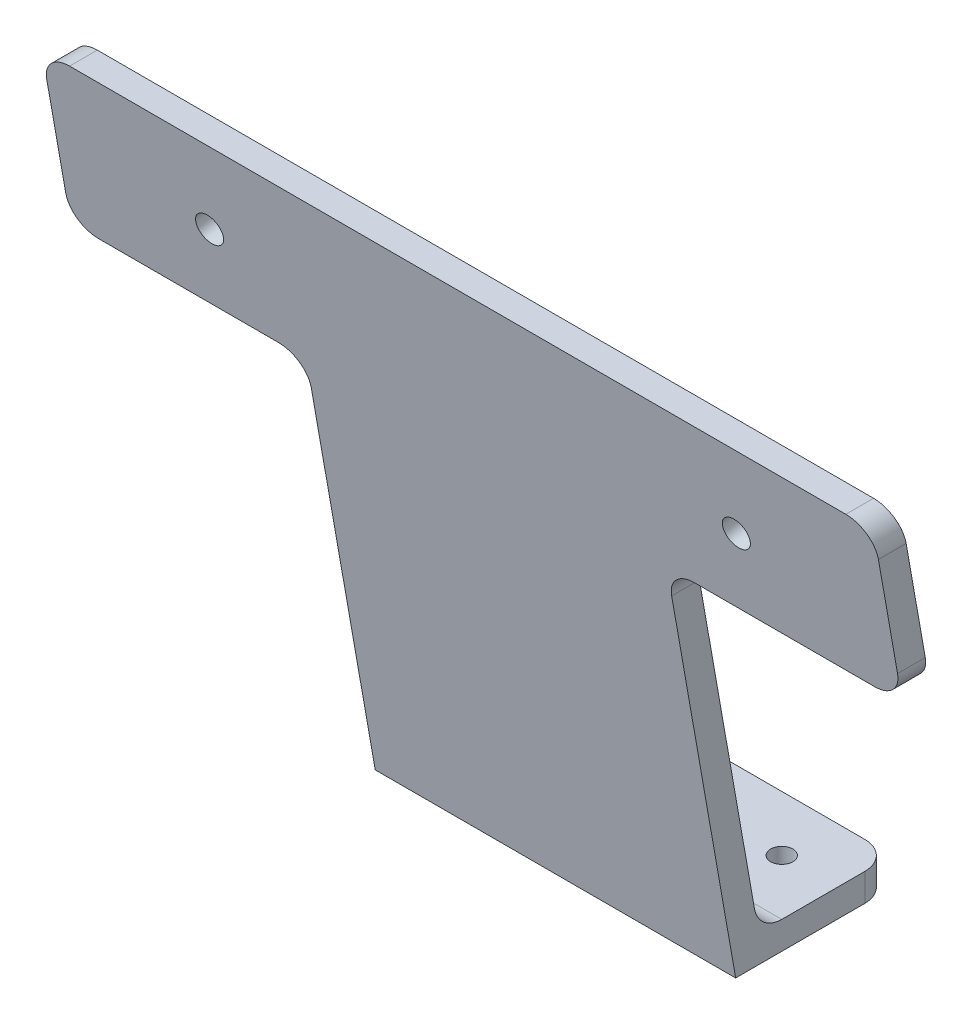
ISO-10303-21;
HEADER;
FILE_DESCRIPTION(('STEP AP214'),'2;1');
FILE_NAME('part.step','',(''),(''),'','','');
FILE_SCHEMA(('AUTOMOTIVE_DESIGN { 1 0 10303 214 1 1 1 1 }'));
ENDSEC;
DATA;
#1=APPLICATION_CONTEXT('core data for automotive mechanical design processes');
#2=APPLICATION_PROTOCOL_DEFINITION('international standard','automotive_design',2000,#1);
#3=PRODUCT_CONTEXT('',#1,'mechanical');
#4=PRODUCT('Part','Part','',(#3));
#5=PRODUCT_RELATED_PRODUCT_CATEGORY('part','',(#4));
#6=PRODUCT_DEFINITION_FORMATION('','',#4);
#7=PRODUCT_DEFINITION_CONTEXT('part definition',#1,'design');
#8=PRODUCT_DEFINITION('design','',#6,#7);
#9=PRODUCT_DEFINITION_SHAPE('','',#8);
#10=(LENGTH_UNIT() NAMED_UNIT(*) SI_UNIT(.MILLI.,.METRE.));
#11=(NAMED_UNIT(*) PLANE_ANGLE_UNIT() SI_UNIT($,.RADIAN.));
#12=(NAMED_UNIT(*) SI_UNIT($,.STERADIAN.) SOLID_ANGLE_UNIT());
#13=UNCERTAINTY_MEASURE_WITH_UNIT(LENGTH_MEASURE(1.E-05),#10,'distance_accuracy_value','');
#14=(GEOMETRIC_REPRESENTATION_CONTEXT(3) GLOBAL_UNCERTAINTY_ASSIGNED_CONTEXT((#13)) GLOBAL_UNIT_ASSIGNED_CONTEXT((#10,
#11,#12)) REPRESENTATION_CONTEXT('',''));
#15=CARTESIAN_POINT('',(0.,0.,0.));
#16=DIRECTION('',(0.,0.,1.));
#17=DIRECTION('',(1.,0.,0.));
#18=AXIS2_PLACEMENT_3D('',#15,#16,#17);
#19=CARTESIAN_POINT('',(65.,5.,-28.3));
#20=DIRECTION('',(0.,-1.,0.));
#21=DIRECTION('',(0.,0.,-1.));
#22=AXIS2_PLACEMENT_3D('',#19,#20,#21);
#23=PLANE('',#22);
#24=CARTESIAN_POINT('',(55.,5.,-18.3138632523441));
#25=DIRECTION('',(0.,1.,0.));
#26=DIRECTION('',(0.,0.,1.));
#27=AXIS2_PLACEMENT_3D('',#24,#25,#26);
#28=CIRCLE('',#27,2.);
#29=CARTESIAN_POINT('',(55.,5.,-16.3138632523441));
#30=VERTEX_POINT('',#29);
#31=EDGE_CURVE('E240',#30,#30,#28,.T.);
#32=ORIENTED_EDGE('',*,*,#31,.F.);
#33=EDGE_LOOP('',(#32));
#34=FACE_BOUND('',#33,.T.);
#35=CARTESIAN_POINT('',(10.,5.,-18.3138632523441));
#36=DIRECTION('',(0.,1.,0.));
#37=DIRECTION('',(0.,0.,1.));
#38=AXIS2_PLACEMENT_3D('',#35,#36,#37);
#39=CIRCLE('',#38,2.);
#40=CARTESIAN_POINT('',(10.,5.,-16.3138632523441));
#41=VERTEX_POINT('',#40);
#42=EDGE_CURVE('E241',#41,#41,#39,.T.);
#43=ORIENTED_EDGE('',*,*,#42,.F.);
#44=EDGE_LOOP('',(#43));
#45=FACE_BOUND('',#44,.T.);
#46=DIRECTION('',(0.,0.,1.));
#47=VECTOR('',#46,1.);
#48=CARTESIAN_POINT('',(36.5,5.,-25.1003449663359));
#49=LINE('',#48,#47);
#50=CARTESIAN_POINT('',(36.5,5.,-25.1003449663359));
#51=VERTEX_POINT('',#50);
#52=CARTESIAN_POINT('',(36.5,5.,-8.3138632523441));
#53=VERTEX_POINT('',#52);
#54=EDGE_CURVE('E225',#51,#53,#49,.T.);
#55=ORIENTED_EDGE('',*,*,#54,.T.);
#56=DIRECTION('',(-1.,0.,0.));
#57=VECTOR('',#56,1.);
#58=CARTESIAN_POINT('',(65.,5.,-8.3138632523441));
#59=LINE('',#58,#57);
#60=CARTESIAN_POINT('',(65.,5.,-8.3138632523441));
#61=VERTEX_POINT('',#60);
#62=EDGE_CURVE('E414',#53,#61,#59,.F.);
#63=ORIENTED_EDGE('',*,*,#62,.T.);
#64=DIRECTION('',(0.,0.,1.));
#65=VECTOR('',#64,1.);
#66=CARTESIAN_POINT('',(65.,5.,-28.3));
#67=LINE('',#66,#65);
#68=CARTESIAN_POINT('',(65.,5.,-23.3));
#69=VERTEX_POINT('',#68);
#70=EDGE_CURVE('E291',#69,#61,#67,.T.);
#71=ORIENTED_EDGE('',*,*,#70,.F.);
#72=CARTESIAN_POINT('',(60.,5.,-23.3));
#73=DIRECTION('',(0.,-1.,0.));
#74=DIRECTION('',(0.,0.,-1.));
#75=AXIS2_PLACEMENT_3D('',#72,#73,#74);
#76=CIRCLE('',#75,5.);
#77=CARTESIAN_POINT('',(60.,5.,-28.3));
#78=VERTEX_POINT('',#77);
#79=EDGE_CURVE('E419',#69,#78,#76,.F.);
#80=ORIENTED_EDGE('',*,*,#79,.T.);
#81=DIRECTION('',(-1.,0.,0.));
#82=VECTOR('',#81,1.);
#83=CARTESIAN_POINT('',(65.,5.,-28.3));
#84=LINE('',#83,#82);
#85=CARTESIAN_POINT('',(5.,5.,-28.3));
#86=VERTEX_POINT('',#85);
#87=EDGE_CURVE('E315',#78,#86,#84,.T.);
#88=ORIENTED_EDGE('',*,*,#87,.T.);
#89=CARTESIAN_POINT('',(5.,5.,-23.3));
#90=DIRECTION('',(0.,-1.,0.));
#91=DIRECTION('',(0.,0.,-1.));
#92=AXIS2_PLACEMENT_3D('',#89,#90,#91);
#93=CIRCLE('',#92,5.);
#94=CARTESIAN_POINT('',(0.,5.,-23.3));
#95=VERTEX_POINT('',#94);
#96=EDGE_CURVE('E422',#86,#95,#93,.F.);
#97=ORIENTED_EDGE('',*,*,#96,.T.);
#98=DIRECTION('',(0.,0.,1.));
#99=VECTOR('',#98,1.);
#100=CARTESIAN_POINT('',(0.,5.,-28.3));
#101=LINE('',#100,#99);
#102=CARTESIAN_POINT('',(0.,5.,-8.3138632523441));
#103=VERTEX_POINT('',#102);
#104=EDGE_CURVE('E305',#95,#103,#101,.T.);
#105=ORIENTED_EDGE('',*,*,#104,.T.);
#106=CARTESIAN_POINT('',(28.5,5.,-8.3138632523441));
#107=VERTEX_POINT('',#106);
#108=EDGE_CURVE('E415',#103,#107,#59,.F.);
#109=ORIENTED_EDGE('',*,*,#108,.T.);
#110=DIRECTION('',(0.,0.,1.));
#111=VECTOR('',#110,1.);
#112=CARTESIAN_POINT('',(28.5,5.,-25.1003449663359));
#113=LINE('',#112,#111);
#114=CARTESIAN_POINT('',(28.5,5.,-25.1003449663359));
#115=VERTEX_POINT('',#114);
#116=EDGE_CURVE('E55',#115,#107,#113,.T.);
#117=ORIENTED_EDGE('',*,*,#116,.F.);
#118=DIRECTION('',(-1.,0.,0.));
#119=VECTOR('',#118,1.);
#120=CARTESIAN_POINT('',(36.5,5.,-25.1003449663359));
#121=LINE('',#120,#119);
#122=EDGE_CURVE('E211',#51,#115,#121,.T.);
#123=ORIENTED_EDGE('',*,*,#122,.F.);
#124=EDGE_LOOP('',(#55,#63,#71,#80,#88,#97,#105,#109,#117,#123));
#125=FACE_BOUND('',#124,.T.);
#126=ADVANCED_FACE('F39',(#34,#45,#125),#23,.F.);
#127=CARTESIAN_POINT('',(65.,5.,-4.11836509645768));
#128=DIRECTION('',(0.,-0.173648177666927,0.984807753012208));
#129=DIRECTION('',(0.,-0.984807753012209,-0.173648177666927));
#130=AXIS2_PLACEMENT_3D('',#127,#128,#129);
#131=PLANE('',#130);
#132=CARTESIAN_POINT('',(80.,85.2278837048169,10.0279754058423));
#133=DIRECTION('',(0.,0.173648177666927,-0.984807753012209));
#134=DIRECTION('',(0.,0.984807753012209,0.173648177666927));
#135=AXIS2_PLACEMENT_3D('',#132,#133,#134);
#136=CIRCLE('',#135,2.50000000000001);
#137=CARTESIAN_POINT('',(80.,87.6899030873474,10.4620958500096));
#138=VERTEX_POINT('',#137);
#139=EDGE_CURVE('E218',#138,#138,#136,.T.);
#140=ORIENTED_EDGE('',*,*,#139,.F.);
#141=EDGE_LOOP('',(#140));
#142=FACE_BOUND('',#141,.T.);
#143=CARTESIAN_POINT('',(-15.,85.2278837048169,10.0279754058423));
#144=DIRECTION('',(0.,0.173648177666927,-0.984807753012209));
#145=DIRECTION('',(0.,0.984807753012209,0.173648177666927));
#146=AXIS2_PLACEMENT_3D('',#143,#144,#145);
#147=CIRCLE('',#146,2.5);
#148=CARTESIAN_POINT('',(-15.,87.6899030873474,10.4620958500096));
#149=VERTEX_POINT('',#148);
#150=EDGE_CURVE('E223',#149,#149,#147,.T.);
#151=ORIENTED_EDGE('',*,*,#150,.F.);
#152=EDGE_LOOP('',(#151));
#153=FACE_BOUND('',#152,.T.);
#154=DIRECTION('',(0.,-0.984807753012209,-0.173648177666927));
#155=VECTOR('',#154,1.);
#156=CARTESIAN_POINT('',(36.5,68.7967511661238,7.13072341567398));
#157=LINE('',#156,#155);
#158=CARTESIAN_POINT('',(36.5,68.7967511661238,7.13072341567398));
#159=VERTEX_POINT('',#158);
#160=CARTESIAN_POINT('',(36.5,9.13175911166536,-3.38982448728305));
#161=VERTEX_POINT('',#160);
#162=EDGE_CURVE('E216',#159,#161,#157,.T.);
#163=ORIENTED_EDGE('',*,*,#162,.F.);
#164=DIRECTION('',(-1.,0.,0.));
#165=VECTOR('',#164,1.);
#166=CARTESIAN_POINT('',(36.5,68.7967511661238,7.13072341567398));
#167=LINE('',#166,#165);
#168=CARTESIAN_POINT('',(28.5,68.7967511661238,7.13072341567398));
#169=VERTEX_POINT('',#168);
#170=EDGE_CURVE('E208',#159,#169,#167,.T.);
#171=ORIENTED_EDGE('',*,*,#170,.T.);
#172=DIRECTION('',(0.,-0.984807753012209,-0.173648177666927));
#173=VECTOR('',#172,1.);
#174=CARTESIAN_POINT('',(28.5,68.7967511661238,7.13072341567398));
#175=LINE('',#174,#173);
#176=CARTESIAN_POINT('',(28.5,9.13175911166536,-3.38982448728305));
#177=VERTEX_POINT('',#176);
#178=EDGE_CURVE('E195',#169,#177,#175,.T.);
#179=ORIENTED_EDGE('',*,*,#178,.T.);
#180=DIRECTION('',(-1.,0.,0.));
#181=VECTOR('',#180,1.);
#182=CARTESIAN_POINT('',(0.,9.13175911166536,-3.38982448728306));
#183=LINE('',#182,#181);
#184=CARTESIAN_POINT('',(0.,9.13175911166536,-3.38982448728305));
#185=VERTEX_POINT('',#184);
#186=EDGE_CURVE('E377',#177,#185,#183,.T.);
#187=ORIENTED_EDGE('',*,*,#186,.T.);
#188=DIRECTION('',(0.,0.984807753012209,0.173648177666927));
#189=VECTOR('',#188,1.);
#190=CARTESIAN_POINT('',(0.,5.,-4.11836509645768));
#191=LINE('',#190,#189);
#192=CARTESIAN_POINT('',(0.,65.4557674096337,6.54161783729606));
#193=VERTEX_POINT('',#192);
#194=EDGE_CURVE('E287',#185,#193,#191,.T.);
#195=ORIENTED_EDGE('',*,*,#194,.T.);
#196=CARTESIAN_POINT('',(-5.,65.4557674096337,6.54161783729607));
#197=DIRECTION('',(0.,-0.173648177666927,0.984807753012208));
#198=DIRECTION('',(0.,-0.984807753012209,-0.173648177666927));
#199=AXIS2_PLACEMENT_3D('',#196,#197,#198);
#200=ELLIPSE('',#199,5.07713305942872,5.);
#201=CARTESIAN_POINT('',(-5.00000000000001,70.4557674096337,7.42325274083838));
#202=VERTEX_POINT('',#201);
#203=EDGE_CURVE('E433',#193,#202,#200,.T.);
#204=ORIENTED_EDGE('',*,*,#203,.T.);
#205=DIRECTION('',(-1.,0.,0.));
#206=VECTOR('',#205,1.);
#207=CARTESIAN_POINT('',(-42.5,70.4557674096337,7.42325274083838));
#208=LINE('',#207,#206);
#209=CARTESIAN_POINT('',(-37.5,70.4557674096337,7.42325274083838));
#210=VERTEX_POINT('',#209);
#211=EDGE_CURVE('E266',#202,#210,#208,.T.);
#212=ORIENTED_EDGE('',*,*,#211,.T.);
#213=CARTESIAN_POINT('',(-37.5,75.4557674096337,8.30488764438067));
#214=DIRECTION('',(0.,-0.173648177666927,0.984807753012208));
#215=DIRECTION('',(0.,0.984807753012209,0.173648177666927));
#216=AXIS2_PLACEMENT_3D('',#213,#214,#215);
#217=ELLIPSE('',#216,5.07713305942872,5.);
#218=CARTESIAN_POINT('',(-42.5,75.4557674096337,8.30488764438068));
#219=VERTEX_POINT('',#218);
#220=EDGE_CURVE('E381',#210,#219,#217,.F.);
#221=ORIENTED_EDGE('',*,*,#220,.T.);
#222=DIRECTION('',(0.,0.984807753012209,0.173648177666927));
#223=VECTOR('',#222,1.);
#224=CARTESIAN_POINT('',(-42.5,73.6387129172025,7.98449191194753));
#225=LINE('',#224,#223);
#226=CARTESIAN_POINT('',(-42.5,95.,11.7510631673039));
#227=VERTEX_POINT('',#226);
#228=EDGE_CURVE('E261',#219,#227,#225,.T.);
#229=ORIENTED_EDGE('',*,*,#228,.T.);
#230=CARTESIAN_POINT('',(-37.5,95.,11.7510631673039));
#231=DIRECTION('',(0.,-0.173648177666927,0.984807753012208));
#232=DIRECTION('',(0.,-0.984807753012209,-0.173648177666927));
#233=AXIS2_PLACEMENT_3D('',#230,#231,#232);
#234=ELLIPSE('',#233,5.07713305942872,5.);
#235=CARTESIAN_POINT('',(-37.5,100.,12.6326980708462));
#236=VERTEX_POINT('',#235);
#237=EDGE_CURVE('E384',#227,#236,#234,.F.);
#238=ORIENTED_EDGE('',*,*,#237,.T.);
#239=DIRECTION('',(-1.,0.,0.));
#240=VECTOR('',#239,1.);
#241=CARTESIAN_POINT('',(65.,100.,12.6326980708462));
#242=LINE('',#241,#240);
#243=CARTESIAN_POINT('',(102.5,100.,12.6326980708462));
#244=VERTEX_POINT('',#243);
#245=EDGE_CURVE('E299',#244,#236,#242,.T.);
#246=ORIENTED_EDGE('',*,*,#245,.F.);
#247=CARTESIAN_POINT('',(102.5,95.,11.7510631673039));
#248=DIRECTION('',(0.,-0.173648177666927,0.984807753012208));
#249=DIRECTION('',(0.,-0.984807753012209,-0.173648177666927));
#250=AXIS2_PLACEMENT_3D('',#247,#248,#249);
#251=ELLIPSE('',#250,5.07713305942872,5.);
#252=CARTESIAN_POINT('',(107.5,95.,11.7510631673039));
#253=VERTEX_POINT('',#252);
#254=EDGE_CURVE('E387',#244,#253,#251,.F.);
#255=ORIENTED_EDGE('',*,*,#254,.T.);
#256=DIRECTION('',(0.,-0.984807753012209,-0.173648177666927));
#257=VECTOR('',#256,1.);
#258=CARTESIAN_POINT('',(107.5,73.6387129172025,7.98449191194753));
#259=LINE('',#258,#257);
#260=CARTESIAN_POINT('',(107.5,75.4557674096337,8.30488764438068));
#261=VERTEX_POINT('',#260);
#262=EDGE_CURVE('E257',#253,#261,#259,.T.);
#263=ORIENTED_EDGE('',*,*,#262,.T.);
#264=CARTESIAN_POINT('',(102.5,75.4557674096337,8.30488764438067));
#265=DIRECTION('',(0.,-0.173648177666927,0.984807753012208));
#266=DIRECTION('',(0.,0.984807753012209,0.173648177666927));
#267=AXIS2_PLACEMENT_3D('',#264,#265,#266);
#268=ELLIPSE('',#267,5.07713305942872,5.);
#269=CARTESIAN_POINT('',(102.5,70.4557674096337,7.42325274083838));
#270=VERTEX_POINT('',#269);
#271=EDGE_CURVE('E390',#261,#270,#268,.F.);
#272=ORIENTED_EDGE('',*,*,#271,.T.);
#273=CARTESIAN_POINT('',(70.,70.4557674096337,7.42325274083838));
#274=VERTEX_POINT('',#273);
#275=EDGE_CURVE('E278',#270,#274,#208,.T.);
#276=ORIENTED_EDGE('',*,*,#275,.T.);
#277=CARTESIAN_POINT('',(70.,65.4557674096337,6.54161783729605));
#278=DIRECTION('',(0.,-0.173648177666927,0.984807753012208));
#279=DIRECTION('',(0.,0.984807753012209,0.173648177666927));
#280=AXIS2_PLACEMENT_3D('',#277,#278,#279);
#281=ELLIPSE('',#280,5.07713305942872,5.);
#282=CARTESIAN_POINT('',(65.,65.4557674096337,6.54161783729606));
#283=VERTEX_POINT('',#282);
#284=EDGE_CURVE('E439',#274,#283,#281,.T.);
#285=ORIENTED_EDGE('',*,*,#284,.T.);
#286=DIRECTION('',(0.,0.984807753012209,0.173648177666927));
#287=VECTOR('',#286,1.);
#288=CARTESIAN_POINT('',(65.,5.,-4.11836509645768));
#289=LINE('',#288,#287);
#290=CARTESIAN_POINT('',(65.,9.13175911166536,-3.38982448728305));
#291=VERTEX_POINT('',#290);
#292=EDGE_CURVE('E295',#291,#283,#289,.T.);
#293=ORIENTED_EDGE('',*,*,#292,.F.);
#294=EDGE_CURVE('E378',#291,#161,#183,.T.);
#295=ORIENTED_EDGE('',*,*,#294,.T.);
#296=EDGE_LOOP('',(#163,#171,#179,#187,#195,#204,#212,#221,#229,#238,#246,#255,#263,#272,#276,
#285,#293,#295));
#297=FACE_BOUND('',#296,.T.);
#298=ADVANCED_FACE('F214',(#142,#153,#297),#131,.F.);
#299=CARTESIAN_POINT('',(65.,10.,-8.3138632523441));
#300=DIRECTION('',(1.,0.,0.));
#301=DIRECTION('',(0.,0.,-1.));
#302=AXIS2_PLACEMENT_3D('',#299,#300,#301);
#303=CYLINDRICAL_SURFACE('',#302,5.);
#304=CARTESIAN_POINT('',(36.5,10.,-8.3138632523441));
#305=DIRECTION('',(-1.,0.,0.));
#306=DIRECTION('',(0.,0.,1.));
#307=AXIS2_PLACEMENT_3D('',#304,#305,#306);
#308=CIRCLE('',#307,5.);
#309=EDGE_CURVE('E463',#53,#161,#308,.T.);
#310=ORIENTED_EDGE('',*,*,#309,.T.);
#311=ORIENTED_EDGE('',*,*,#294,.F.);
#312=CARTESIAN_POINT('',(65.,10.,-8.3138632523441));
#313=DIRECTION('',(-1.,0.,0.));
#314=DIRECTION('',(0.,0.,1.));
#315=AXIS2_PLACEMENT_3D('',#312,#313,#314);
#316=CIRCLE('',#315,5.);
#317=EDGE_CURVE('E11',#61,#291,#316,.T.);
#318=ORIENTED_EDGE('',*,*,#317,.F.);
#319=ORIENTED_EDGE('',*,*,#62,.F.);
#320=EDGE_LOOP('',(#310,#311,#318,#319));
#321=FACE_BOUND('',#320,.T.);
#322=ADVANCED_FACE('F473',(#321),#303,.F.);
#323=CARTESIAN_POINT('',(65.,100.,12.6326980708462));
#324=DIRECTION('',(0.,-1.,0.));
#325=DIRECTION('',(0.,0.,-1.));
#326=AXIS2_PLACEMENT_3D('',#323,#324,#325);
#327=PLANE('',#326);
#328=DIRECTION('',(-1.,0.,0.));
#329=VECTOR('',#328,1.);
#330=CARTESIAN_POINT('',(65.,100.,17.6326980708462));
#331=LINE('',#330,#329);
#332=CARTESIAN_POINT('',(102.5,100.,17.6326980708462));
#333=VERTEX_POINT('',#332);
#334=CARTESIAN_POINT('',(-37.5,100.,17.6326980708462));
#335=VERTEX_POINT('',#334);
#336=EDGE_CURVE('E326',#333,#335,#331,.T.);
#337=ORIENTED_EDGE('',*,*,#336,.F.);
#338=DIRECTION('',(0.,0.,1.));
#339=VECTOR('',#338,1.);
#340=CARTESIAN_POINT('',(102.5,100.,12.6326980708462));
#341=LINE('',#340,#339);
#342=EDGE_CURVE('E397',#333,#244,#341,.F.);
#343=ORIENTED_EDGE('',*,*,#342,.T.);
#344=ORIENTED_EDGE('',*,*,#245,.T.);
#345=DIRECTION('',(0.,0.,1.));
#346=VECTOR('',#345,1.);
#347=CARTESIAN_POINT('',(-37.5,100.,17.6326980708462));
#348=LINE('',#347,#346);
#349=EDGE_CURVE('E393',#236,#335,#348,.T.);
#350=ORIENTED_EDGE('',*,*,#349,.T.);
#351=EDGE_LOOP('',(#337,#343,#344,#350));
#352=FACE_BOUND('',#351,.T.);
#353=ADVANCED_FACE('F506',(#352),#327,.F.);
#354=CARTESIAN_POINT('',(65.,100.,17.6326980708462));
#355=DIRECTION('',(0.,0.173648177666927,-0.984807753012208));
#356=DIRECTION('',(0.,0.984807753012209,0.173648177666927));
#357=AXIS2_PLACEMENT_3D('',#354,#355,#356);
#358=PLANE('',#357);
#359=CARTESIAN_POINT('',(-15.,84.3728333465027,14.877206957807));
#360=DIRECTION('',(0.,0.173648177666927,-0.984807753012208));
#361=DIRECTION('',(0.,0.984807753012209,0.173648177666927));
#362=AXIS2_PLACEMENT_3D('',#359,#360,#361);
#363=CIRCLE('',#362,2.5);
#364=CARTESIAN_POINT('',(-15.,86.8348527290332,15.3113274019744));
#365=VERTEX_POINT('',#364);
#366=EDGE_CURVE('E236',#365,#365,#363,.T.);
#367=ORIENTED_EDGE('',*,*,#366,.T.);
#368=EDGE_LOOP('',(#367));
#369=FACE_BOUND('',#368,.T.);
#370=CARTESIAN_POINT('',(80.,84.3728333465027,14.877206957807));
#371=DIRECTION('',(0.,0.173648177666927,-0.984807753012208));
#372=DIRECTION('',(0.,0.984807753012209,0.173648177666927));
#373=AXIS2_PLACEMENT_3D('',#370,#371,#372);
#374=CIRCLE('',#373,2.50000000000001);
#375=CARTESIAN_POINT('',(80.,86.8348527290332,15.3113274019744));
#376=VERTEX_POINT('',#375);
#377=EDGE_CURVE('E231',#376,#376,#374,.T.);
#378=ORIENTED_EDGE('',*,*,#377,.T.);
#379=EDGE_LOOP('',(#378));
#380=FACE_BOUND('',#379,.T.);
#381=DIRECTION('',(1.,0.,0.));
#382=VECTOR('',#381,1.);
#383=CARTESIAN_POINT('',(-42.5,70.4557674096337,12.4232527408384));
#384=LINE('',#383,#382);
#385=CARTESIAN_POINT('',(70.,70.4557674096337,12.4232527408384));
#386=VERTEX_POINT('',#385);
#387=CARTESIAN_POINT('',(102.5,70.4557674096337,12.4232527408384));
#388=VERTEX_POINT('',#387);
#389=EDGE_CURVE('E270',#386,#388,#384,.T.);
#390=ORIENTED_EDGE('',*,*,#389,.T.);
#391=CARTESIAN_POINT('',(102.5,75.4557674096337,13.3048876443807));
#392=DIRECTION('',(0.,0.173648177666927,-0.984807753012208));
#393=DIRECTION('',(0.,0.984807753012209,0.173648177666927));
#394=AXIS2_PLACEMENT_3D('',#391,#392,#393);
#395=ELLIPSE('',#394,5.07713305942872,5.);
#396=CARTESIAN_POINT('',(107.5,75.4557674096338,13.3048876443807));
#397=VERTEX_POINT('',#396);
#398=EDGE_CURVE('E367',#388,#397,#395,.F.);
#399=ORIENTED_EDGE('',*,*,#398,.T.);
#400=DIRECTION('',(0.,0.984807753012208,0.173648177666927));
#401=VECTOR('',#400,1.);
#402=CARTESIAN_POINT('',(107.5,100.,17.6326980708462));
#403=LINE('',#402,#401);
#404=CARTESIAN_POINT('',(107.5,95.,16.7510631673039));
#405=VERTEX_POINT('',#404);
#406=EDGE_CURVE('E262',#397,#405,#403,.T.);
#407=ORIENTED_EDGE('',*,*,#406,.T.);
#408=CARTESIAN_POINT('',(102.5,95.,16.7510631673039));
#409=DIRECTION('',(0.,0.173648177666927,-0.984807753012208));
#410=DIRECTION('',(0.,-0.984807753012209,-0.173648177666927));
#411=AXIS2_PLACEMENT_3D('',#408,#409,#410);
#412=ELLIPSE('',#411,5.07713305942872,5.);
#413=EDGE_CURVE('E364',#405,#333,#412,.F.);
#414=ORIENTED_EDGE('',*,*,#413,.T.);
#415=ORIENTED_EDGE('',*,*,#336,.T.);
#416=CARTESIAN_POINT('',(-37.5,95.,16.7510631673039));
#417=DIRECTION('',(0.,0.173648177666927,-0.984807753012208));
#418=DIRECTION('',(0.,-0.984807753012209,-0.173648177666927));
#419=AXIS2_PLACEMENT_3D('',#416,#417,#418);
#420=ELLIPSE('',#419,5.07713305942872,5.);
#421=CARTESIAN_POINT('',(-42.5,95.,16.7510631673039));
#422=VERTEX_POINT('',#421);
#423=EDGE_CURVE('E361',#335,#422,#420,.F.);
#424=ORIENTED_EDGE('',*,*,#423,.T.);
#425=DIRECTION('',(0.,-0.984807753012208,-0.173648177666927));
#426=VECTOR('',#425,1.);
#427=CARTESIAN_POINT('',(-42.5,100.,17.6326980708462));
#428=LINE('',#427,#426);
#429=CARTESIAN_POINT('',(-42.5,75.4557674096338,13.3048876443807));
#430=VERTEX_POINT('',#429);
#431=EDGE_CURVE('E250',#422,#430,#428,.T.);
#432=ORIENTED_EDGE('',*,*,#431,.T.);
#433=CARTESIAN_POINT('',(-37.5,75.4557674096337,13.3048876443807));
#434=DIRECTION('',(0.,0.173648177666927,-0.984807753012208));
#435=DIRECTION('',(0.,0.984807753012209,0.173648177666927));
#436=AXIS2_PLACEMENT_3D('',#433,#434,#435);
#437=ELLIPSE('',#436,5.07713305942872,5.);
#438=CARTESIAN_POINT('',(-37.5,70.4557674096337,12.4232527408384));
#439=VERTEX_POINT('',#438);
#440=EDGE_CURVE('E358',#430,#439,#437,.F.);
#441=ORIENTED_EDGE('',*,*,#440,.T.);
#442=CARTESIAN_POINT('',(-5.,70.4557674096337,12.4232527408384));
#443=VERTEX_POINT('',#442);
#444=EDGE_CURVE('E274',#439,#443,#384,.T.);
#445=ORIENTED_EDGE('',*,*,#444,.T.);
#446=CARTESIAN_POINT('',(-5.,65.4557674096337,11.541617837296));
#447=DIRECTION('',(0.,0.173648177666927,-0.984807753012208));
#448=DIRECTION('',(0.,-0.984807753012209,-0.173648177666927));
#449=AXIS2_PLACEMENT_3D('',#446,#447,#448);
#450=ELLIPSE('',#449,5.07713305942872,5.);
#451=CARTESIAN_POINT('',(0.,65.4557674096337,11.5416178372961));
#452=VERTEX_POINT('',#451);
#453=EDGE_CURVE('E430',#443,#452,#450,.T.);
#454=ORIENTED_EDGE('',*,*,#453,.T.);
#455=DIRECTION('',(0.,-0.984807753012209,-0.173648177666927));
#456=VECTOR('',#455,1.);
#457=CARTESIAN_POINT('',(0.,100.,17.6326980708462));
#458=LINE('',#457,#456);
#459=CARTESIAN_POINT('',(0.,0.,0.));
#460=VERTEX_POINT('',#459);
#461=EDGE_CURVE('E282',#452,#460,#458,.T.);
#462=ORIENTED_EDGE('',*,*,#461,.T.);
#463=DIRECTION('',(-1.,0.,0.));
#464=VECTOR('',#463,1.);
#465=CARTESIAN_POINT('',(65.,0.,0.));
#466=LINE('',#465,#464);
#467=CARTESIAN_POINT('',(65.,0.,0.));
#468=VERTEX_POINT('',#467);
#469=EDGE_CURVE('E322',#468,#460,#466,.T.);
#470=ORIENTED_EDGE('',*,*,#469,.F.);
#471=DIRECTION('',(0.,-0.984807753012209,-0.173648177666927));
#472=VECTOR('',#471,1.);
#473=CARTESIAN_POINT('',(65.,100.,17.6326980708462));
#474=LINE('',#473,#472);
#475=CARTESIAN_POINT('',(65.,65.4557674096337,11.5416178372961));
#476=VERTEX_POINT('',#475);
#477=EDGE_CURVE('E283',#476,#468,#474,.T.);
#478=ORIENTED_EDGE('',*,*,#477,.F.);
#479=CARTESIAN_POINT('',(70.,65.4557674096337,11.5416178372961));
#480=DIRECTION('',(0.,0.173648177666927,-0.984807753012208));
#481=DIRECTION('',(0.,0.984807753012209,0.173648177666927));
#482=AXIS2_PLACEMENT_3D('',#479,#480,#481);
#483=ELLIPSE('',#482,5.07713305942872,5.);
#484=EDGE_CURVE('E436',#476,#386,#483,.T.);
#485=ORIENTED_EDGE('',*,*,#484,.T.);
#486=EDGE_LOOP('',(#390,#399,#407,#414,#415,#424,#432,#441,#445,#454,#462,#470,#478,#485));
#487=FACE_BOUND('',#486,.T.);
#488=ADVANCED_FACE('F483',(#369,#380,#487),#358,.F.);
#489=CARTESIAN_POINT('',(65.,0.,0.));
#490=DIRECTION('',(0.,1.,0.));
#491=DIRECTION('',(0.,0.,1.));
#492=AXIS2_PLACEMENT_3D('',#489,#490,#491);
#493=PLANE('',#492);
#494=CARTESIAN_POINT('',(10.,0.,-18.3138632523441));
#495=DIRECTION('',(0.,1.,0.));
#496=DIRECTION('',(0.,0.,1.));
#497=AXIS2_PLACEMENT_3D('',#494,#495,#496);
#498=CIRCLE('',#497,2.);
#499=CARTESIAN_POINT('',(10.,0.,-16.3138632523441));
#500=VERTEX_POINT('',#499);
#501=EDGE_CURVE('E245',#500,#500,#498,.F.);
#502=ORIENTED_EDGE('',*,*,#501,.F.);
#503=EDGE_LOOP('',(#502));
#504=FACE_BOUND('',#503,.T.);
#505=CARTESIAN_POINT('',(55.,0.,-18.3138632523441));
#506=DIRECTION('',(0.,1.,0.));
#507=DIRECTION('',(0.,0.,1.));
#508=AXIS2_PLACEMENT_3D('',#505,#506,#507);
#509=CIRCLE('',#508,2.);
#510=CARTESIAN_POINT('',(55.,0.,-16.3138632523441));
#511=VERTEX_POINT('',#510);
#512=EDGE_CURVE('E246',#511,#511,#509,.F.);
#513=ORIENTED_EDGE('',*,*,#512,.F.);
#514=EDGE_LOOP('',(#513));
#515=FACE_BOUND('',#514,.T.);
#516=DIRECTION('',(0.,0.,-1.));
#517=VECTOR('',#516,1.);
#518=CARTESIAN_POINT('',(0.,0.,0.));
#519=LINE('',#518,#517);
#520=CARTESIAN_POINT('',(0.,0.,-23.3));
#521=VERTEX_POINT('',#520);
#522=EDGE_CURVE('E302',#460,#521,#519,.T.);
#523=ORIENTED_EDGE('',*,*,#522,.T.);
#524=CARTESIAN_POINT('',(5.,0.,-23.3));
#525=DIRECTION('',(0.,1.,0.));
#526=DIRECTION('',(0.,0.,1.));
#527=AXIS2_PLACEMENT_3D('',#524,#525,#526);
#528=CIRCLE('',#527,5.);
#529=CARTESIAN_POINT('',(5.,0.,-28.3));
#530=VERTEX_POINT('',#529);
#531=EDGE_CURVE('E63',#521,#530,#528,.F.);
#532=ORIENTED_EDGE('',*,*,#531,.T.);
#533=DIRECTION('',(-1.,0.,0.));
#534=VECTOR('',#533,1.);
#535=CARTESIAN_POINT('',(65.,0.,-28.3));
#536=LINE('',#535,#534);
#537=CARTESIAN_POINT('',(60.,0.,-28.3));
#538=VERTEX_POINT('',#537);
#539=EDGE_CURVE('E319',#538,#530,#536,.T.);
#540=ORIENTED_EDGE('',*,*,#539,.F.);
#541=CARTESIAN_POINT('',(60.,0.,-23.3));
#542=DIRECTION('',(0.,1.,0.));
#543=DIRECTION('',(0.,0.,1.));
#544=AXIS2_PLACEMENT_3D('',#541,#542,#543);
#545=CIRCLE('',#544,5.);
#546=CARTESIAN_POINT('',(65.,0.,-23.3));
#547=VERTEX_POINT('',#546);
#548=EDGE_CURVE('E425',#538,#547,#545,.F.);
#549=ORIENTED_EDGE('',*,*,#548,.T.);
#550=DIRECTION('',(0.,0.,-1.));
#551=VECTOR('',#550,1.);
#552=CARTESIAN_POINT('',(65.,0.,0.));
#553=LINE('',#552,#551);
#554=EDGE_CURVE('E286',#468,#547,#553,.T.);
#555=ORIENTED_EDGE('',*,*,#554,.F.);
#556=ORIENTED_EDGE('',*,*,#469,.T.);
#557=EDGE_LOOP('',(#523,#532,#540,#549,#555,#556));
#558=FACE_BOUND('',#557,.T.);
#559=ADVANCED_FACE('F543',(#504,#515,#558),#493,.F.);
#560=CARTESIAN_POINT('',(65.,0.,-28.3));
#561=DIRECTION('',(0.,0.,1.));
#562=DIRECTION('',(1.,0.,0.));
#563=AXIS2_PLACEMENT_3D('',#560,#561,#562);
#564=PLANE('',#563);
#565=ORIENTED_EDGE('',*,*,#539,.T.);
#566=DIRECTION('',(0.,1.,0.));
#567=VECTOR('',#566,1.);
#568=CARTESIAN_POINT('',(5.,5.,-28.3));
#569=LINE('',#568,#567);
#570=EDGE_CURVE('E410',#530,#86,#569,.T.);
#571=ORIENTED_EDGE('',*,*,#570,.T.);
#572=ORIENTED_EDGE('',*,*,#87,.F.);
#573=DIRECTION('',(0.,1.,0.));
#574=VECTOR('',#573,1.);
#575=CARTESIAN_POINT('',(60.,0.,-28.3));
#576=LINE('',#575,#574);
#577=EDGE_CURVE('E407',#78,#538,#576,.F.);
#578=ORIENTED_EDGE('',*,*,#577,.T.);
#579=EDGE_LOOP('',(#565,#571,#572,#578));
#580=FACE_BOUND('',#579,.T.);
#581=ADVANCED_FACE('F538',(#580),#564,.F.);
#582=CARTESIAN_POINT('',(65.,0.,0.));
#583=DIRECTION('',(-1.,0.,0.));
#584=DIRECTION('',(0.,0.,1.));
#585=AXIS2_PLACEMENT_3D('',#582,#583,#584);
#586=PLANE('',#585);
#587=ORIENTED_EDGE('',*,*,#292,.T.);
#588=DIRECTION('',(0.,0.,1.));
#589=VECTOR('',#588,1.);
#590=CARTESIAN_POINT('',(65.,65.4557674096337,0.));
#591=LINE('',#590,#589);
#592=EDGE_CURVE('E347',#283,#476,#591,.T.);
#593=ORIENTED_EDGE('',*,*,#592,.T.);
#594=ORIENTED_EDGE('',*,*,#477,.T.);
#595=ORIENTED_EDGE('',*,*,#554,.T.);
#596=DIRECTION('',(0.,1.,0.));
#597=VECTOR('',#596,1.);
#598=CARTESIAN_POINT('',(65.,0.,-23.3));
#599=LINE('',#598,#597);
#600=EDGE_CURVE('E343',#547,#69,#599,.T.);
#601=ORIENTED_EDGE('',*,*,#600,.T.);
#602=ORIENTED_EDGE('',*,*,#70,.T.);
#603=ORIENTED_EDGE('',*,*,#317,.T.);
#604=EDGE_LOOP('',(#587,#593,#594,#595,#601,#602,#603));
#605=FACE_BOUND('',#604,.T.);
#606=ADVANCED_FACE('F531',(#605),#586,.F.);
#607=CARTESIAN_POINT('',(0.,0.,0.));
#608=DIRECTION('',(-1.,0.,0.));
#609=DIRECTION('',(0.,0.,1.));
#610=AXIS2_PLACEMENT_3D('',#607,#608,#609);
#611=PLANE('',#610);
#612=ORIENTED_EDGE('',*,*,#461,.F.);
#613=DIRECTION('',(0.,0.,1.));
#614=VECTOR('',#613,1.);
#615=CARTESIAN_POINT('',(0.,65.4557674096337,7.42325274083838));
#616=LINE('',#615,#614);
#617=EDGE_CURVE('E340',#452,#193,#616,.F.);
#618=ORIENTED_EDGE('',*,*,#617,.T.);
#619=ORIENTED_EDGE('',*,*,#194,.F.);
#620=CARTESIAN_POINT('',(0.,10.,-8.3138632523441));
#621=DIRECTION('',(-1.,0.,0.));
#622=DIRECTION('',(0.,0.,1.));
#623=AXIS2_PLACEMENT_3D('',#620,#621,#622);
#624=CIRCLE('',#623,5.);
#625=EDGE_CURVE('E48',#185,#103,#624,.F.);
#626=ORIENTED_EDGE('',*,*,#625,.T.);
#627=ORIENTED_EDGE('',*,*,#104,.F.);
#628=DIRECTION('',(0.,1.,0.));
#629=VECTOR('',#628,1.);
#630=CARTESIAN_POINT('',(0.,0.,-23.3));
#631=LINE('',#630,#629);
#632=EDGE_CURVE('E337',#95,#521,#631,.F.);
#633=ORIENTED_EDGE('',*,*,#632,.T.);
#634=ORIENTED_EDGE('',*,*,#522,.F.);
#635=EDGE_LOOP('',(#612,#618,#619,#626,#627,#633,#634));
#636=FACE_BOUND('',#635,.T.);
#637=ADVANCED_FACE('F447',(#636),#611,.T.);
#638=CARTESIAN_POINT('',(-42.5,100.,-141.517796262448));
#639=DIRECTION('',(-1.,0.,0.));
#640=DIRECTION('',(0.,-1.,0.));
#641=AXIS2_PLACEMENT_3D('',#638,#639,#640);
#642=PLANE('',#641);
#643=ORIENTED_EDGE('',*,*,#431,.F.);
#644=DIRECTION('',(0.,0.,1.));
#645=VECTOR('',#644,1.);
#646=CARTESIAN_POINT('',(-42.5,95.,12.6326980708462));
#647=LINE('',#646,#645);
#648=EDGE_CURVE('E404',#422,#227,#647,.F.);
#649=ORIENTED_EDGE('',*,*,#648,.T.);
#650=ORIENTED_EDGE('',*,*,#228,.F.);
#651=DIRECTION('',(0.,0.,1.));
#652=VECTOR('',#651,1.);
#653=CARTESIAN_POINT('',(-42.5,75.4557674096337,-141.517796262448));
#654=LINE('',#653,#652);
#655=EDGE_CURVE('E400',#219,#430,#654,.T.);
#656=ORIENTED_EDGE('',*,*,#655,.T.);
#657=EDGE_LOOP('',(#643,#649,#650,#656));
#658=FACE_BOUND('',#657,.T.);
#659=ADVANCED_FACE('F497',(#658),#642,.T.);
#660=CARTESIAN_POINT('',(-42.5,70.4557674096337,-146.727241592456));
#661=DIRECTION('',(0.,-1.,0.));
#662=DIRECTION('',(0.,0.,-1.));
#663=AXIS2_PLACEMENT_3D('',#660,#661,#662);
#664=PLANE('',#663);
#665=ORIENTED_EDGE('',*,*,#211,.F.);
#666=DIRECTION('',(0.,0.,1.));
#667=VECTOR('',#666,1.);
#668=CARTESIAN_POINT('',(-5.,70.4557674096337,12.4232527408384));
#669=LINE('',#668,#667);
#670=EDGE_CURVE('E333',#202,#443,#669,.T.);
#671=ORIENTED_EDGE('',*,*,#670,.T.);
#672=ORIENTED_EDGE('',*,*,#444,.F.);
#673=DIRECTION('',(0.,0.,1.));
#674=VECTOR('',#673,1.);
#675=CARTESIAN_POINT('',(-37.5,70.4557674096337,-146.727241592456));
#676=LINE('',#675,#674);
#677=EDGE_CURVE('E330',#439,#210,#676,.F.);
#678=ORIENTED_EDGE('',*,*,#677,.T.);
#679=EDGE_LOOP('',(#665,#671,#672,#678));
#680=FACE_BOUND('',#679,.T.);
#681=ADVANCED_FACE('F487',(#680),#664,.T.);
#682=ORIENTED_EDGE('',*,*,#389,.F.);
#683=DIRECTION('',(0.,0.,1.));
#684=VECTOR('',#683,1.);
#685=CARTESIAN_POINT('',(70.,70.4557674096337,-146.727241592456));
#686=LINE('',#685,#684);
#687=EDGE_CURVE('E355',#386,#274,#686,.F.);
#688=ORIENTED_EDGE('',*,*,#687,.T.);
#689=ORIENTED_EDGE('',*,*,#275,.F.);
#690=DIRECTION('',(0.,0.,1.));
#691=VECTOR('',#690,1.);
#692=CARTESIAN_POINT('',(102.5,70.4557674096337,-146.727241592456));
#693=LINE('',#692,#691);
#694=EDGE_CURVE('E351',#270,#388,#693,.T.);
#695=ORIENTED_EDGE('',*,*,#694,.T.);
#696=EDGE_LOOP('',(#682,#688,#689,#695));
#697=FACE_BOUND('',#696,.T.);
#698=ADVANCED_FACE('F524',(#697),#664,.T.);
#699=CARTESIAN_POINT('',(107.5,100.,-141.517796262448));
#700=DIRECTION('',(1.,0.,0.));
#701=DIRECTION('',(0.,1.,0.));
#702=AXIS2_PLACEMENT_3D('',#699,#700,#701);
#703=PLANE('',#702);
#704=ORIENTED_EDGE('',*,*,#406,.F.);
#705=DIRECTION('',(0.,0.,1.));
#706=VECTOR('',#705,1.);
#707=CARTESIAN_POINT('',(107.5,75.4557674096337,-141.517796262448));
#708=LINE('',#707,#706);
#709=EDGE_CURVE('E374',#397,#261,#708,.F.);
#710=ORIENTED_EDGE('',*,*,#709,.T.);
#711=ORIENTED_EDGE('',*,*,#262,.F.);
#712=DIRECTION('',(0.,0.,1.));
#713=VECTOR('',#712,1.);
#714=CARTESIAN_POINT('',(107.5,95.,17.6326980708462));
#715=LINE('',#714,#713);
#716=EDGE_CURVE('E370',#253,#405,#715,.T.);
#717=ORIENTED_EDGE('',*,*,#716,.T.);
#718=EDGE_LOOP('',(#704,#710,#711,#717));
#719=FACE_BOUND('',#718,.T.);
#720=ADVANCED_FACE('F515',(#719),#703,.T.);
#721=CARTESIAN_POINT('',(-5.,65.4557674096337,-146.727241592456));
#722=DIRECTION('',(0.,0.,-1.));
#723=DIRECTION('',(-1.,0.,0.));
#724=AXIS2_PLACEMENT_3D('',#721,#722,#723);
#725=CYLINDRICAL_SURFACE('',#724,5.);
#726=ORIENTED_EDGE('',*,*,#203,.F.);
#727=ORIENTED_EDGE('',*,*,#617,.F.);
#728=ORIENTED_EDGE('',*,*,#453,.F.);
#729=ORIENTED_EDGE('',*,*,#670,.F.);
#730=EDGE_LOOP('',(#726,#727,#728,#729));
#731=FACE_BOUND('',#730,.T.);
#732=ADVANCED_FACE('F578',(#731),#725,.F.);
#733=CARTESIAN_POINT('',(70.,65.4557674096337,0.));
#734=DIRECTION('',(0.,0.,1.));
#735=DIRECTION('',(1.,0.,0.));
#736=AXIS2_PLACEMENT_3D('',#733,#734,#735);
#737=CYLINDRICAL_SURFACE('',#736,5.);
#738=ORIENTED_EDGE('',*,*,#284,.F.);
#739=ORIENTED_EDGE('',*,*,#687,.F.);
#740=ORIENTED_EDGE('',*,*,#484,.F.);
#741=ORIENTED_EDGE('',*,*,#592,.F.);
#742=EDGE_LOOP('',(#738,#739,#740,#741));
#743=FACE_BOUND('',#742,.T.);
#744=ADVANCED_FACE('F527',(#743),#737,.F.);
#745=CARTESIAN_POINT('',(102.5,75.4557674096337,-146.727241592456));
#746=DIRECTION('',(0.,0.,1.));
#747=DIRECTION('',(1.,0.,0.));
#748=AXIS2_PLACEMENT_3D('',#745,#746,#747);
#749=CYLINDRICAL_SURFACE('',#748,5.);
#750=ORIENTED_EDGE('',*,*,#271,.F.);
#751=ORIENTED_EDGE('',*,*,#709,.F.);
#752=ORIENTED_EDGE('',*,*,#398,.F.);
#753=ORIENTED_EDGE('',*,*,#694,.F.);
#754=EDGE_LOOP('',(#750,#751,#752,#753));
#755=FACE_BOUND('',#754,.T.);
#756=ADVANCED_FACE('F518',(#755),#749,.T.);
#757=CARTESIAN_POINT('',(102.5,95.,-141.517796262448));
#758=DIRECTION('',(0.,0.,-1.));
#759=DIRECTION('',(-1.,0.,0.));
#760=AXIS2_PLACEMENT_3D('',#757,#758,#759);
#761=CYLINDRICAL_SURFACE('',#760,5.);
#762=ORIENTED_EDGE('',*,*,#254,.F.);
#763=ORIENTED_EDGE('',*,*,#342,.F.);
#764=ORIENTED_EDGE('',*,*,#413,.F.);
#765=ORIENTED_EDGE('',*,*,#716,.F.);
#766=EDGE_LOOP('',(#762,#763,#764,#765));
#767=FACE_BOUND('',#766,.T.);
#768=ADVANCED_FACE('F509',(#767),#761,.T.);
#769=CARTESIAN_POINT('',(-37.5,95.,12.6326980708462));
#770=DIRECTION('',(0.,0.,-1.));
#771=DIRECTION('',(-1.,0.,0.));
#772=AXIS2_PLACEMENT_3D('',#769,#770,#771);
#773=CYLINDRICAL_SURFACE('',#772,5.);
#774=ORIENTED_EDGE('',*,*,#237,.F.);
#775=ORIENTED_EDGE('',*,*,#648,.F.);
#776=ORIENTED_EDGE('',*,*,#423,.F.);
#777=ORIENTED_EDGE('',*,*,#349,.F.);
#778=EDGE_LOOP('',(#774,#775,#776,#777));
#779=FACE_BOUND('',#778,.T.);
#780=ADVANCED_FACE('F500',(#779),#773,.T.);
#781=CARTESIAN_POINT('',(-37.5,75.4557674096337,-141.517796262448));
#782=DIRECTION('',(0.,0.,1.));
#783=DIRECTION('',(1.,0.,0.));
#784=AXIS2_PLACEMENT_3D('',#781,#782,#783);
#785=CYLINDRICAL_SURFACE('',#784,5.);
#786=ORIENTED_EDGE('',*,*,#220,.F.);
#787=ORIENTED_EDGE('',*,*,#677,.F.);
#788=ORIENTED_EDGE('',*,*,#440,.F.);
#789=ORIENTED_EDGE('',*,*,#655,.F.);
#790=EDGE_LOOP('',(#786,#787,#788,#789));
#791=FACE_BOUND('',#790,.T.);
#792=ADVANCED_FACE('F491',(#791),#785,.T.);
#793=CARTESIAN_POINT('',(5.,0.,-23.3));
#794=DIRECTION('',(0.,-1.,0.));
#795=DIRECTION('',(0.,0.,-1.));
#796=AXIS2_PLACEMENT_3D('',#793,#794,#795);
#797=CYLINDRICAL_SURFACE('',#796,5.);
#798=ORIENTED_EDGE('',*,*,#531,.F.);
#799=ORIENTED_EDGE('',*,*,#632,.F.);
#800=ORIENTED_EDGE('',*,*,#96,.F.);
#801=ORIENTED_EDGE('',*,*,#570,.F.);
#802=EDGE_LOOP('',(#798,#799,#800,#801));
#803=FACE_BOUND('',#802,.T.);
#804=ADVANCED_FACE('F548',(#803),#797,.T.);
#805=CARTESIAN_POINT('',(60.,0.,-23.3));
#806=DIRECTION('',(0.,1.,0.));
#807=DIRECTION('',(0.,0.,1.));
#808=AXIS2_PLACEMENT_3D('',#805,#806,#807);
#809=CYLINDRICAL_SURFACE('',#808,5.);
#810=ORIENTED_EDGE('',*,*,#548,.F.);
#811=ORIENTED_EDGE('',*,*,#577,.F.);
#812=ORIENTED_EDGE('',*,*,#79,.F.);
#813=ORIENTED_EDGE('',*,*,#600,.F.);
#814=EDGE_LOOP('',(#810,#811,#812,#813));
#815=FACE_BOUND('',#814,.T.);
#816=ADVANCED_FACE('F541',(#815),#809,.T.);
#817=ORIENTED_EDGE('',*,*,#186,.F.);
#818=CARTESIAN_POINT('',(28.5,10.,-8.3138632523441));
#819=DIRECTION('',(-1.,0.,0.));
#820=DIRECTION('',(0.,0.,1.));
#821=AXIS2_PLACEMENT_3D('',#818,#819,#820);
#822=CIRCLE('',#821,5.);
#823=EDGE_CURVE('E199',#107,#177,#822,.T.);
#824=ORIENTED_EDGE('',*,*,#823,.F.);
#825=ORIENTED_EDGE('',*,*,#108,.F.);
#826=ORIENTED_EDGE('',*,*,#625,.F.);
#827=EDGE_LOOP('',(#817,#824,#825,#826));
#828=FACE_BOUND('',#827,.T.);
#829=ADVANCED_FACE('F41',(#828),#303,.F.);
#830=CARTESIAN_POINT('',(55.,-0.00100000000000187,-18.3138632523441));
#831=DIRECTION('',(0.,1.,0.));
#832=DIRECTION('',(0.,0.,1.));
#833=AXIS2_PLACEMENT_3D('',#830,#831,#832);
#834=CYLINDRICAL_SURFACE('',#833,2.);
#835=ORIENTED_EDGE('',*,*,#31,.T.);
#836=EDGE_LOOP('',(#835));
#837=FACE_BOUND('',#836,.T.);
#838=ORIENTED_EDGE('',*,*,#512,.T.);
#839=EDGE_LOOP('',(#838));
#840=FACE_BOUND('',#839,.T.);
#841=ADVANCED_FACE('F622',(#837,#840),#834,.F.);
#842=CARTESIAN_POINT('',(10.,-0.00100000000000187,-18.3138632523441));
#843=DIRECTION('',(0.,1.,0.));
#844=DIRECTION('',(0.,0.,1.));
#845=AXIS2_PLACEMENT_3D('',#842,#843,#844);
#846=CYLINDRICAL_SURFACE('',#845,2.);
#847=ORIENTED_EDGE('',*,*,#42,.T.);
#848=EDGE_LOOP('',(#847));
#849=FACE_BOUND('',#848,.T.);
#850=ORIENTED_EDGE('',*,*,#501,.T.);
#851=EDGE_LOOP('',(#850));
#852=FACE_BOUND('',#851,.T.);
#853=ADVANCED_FACE('F627',(#849,#852),#846,.F.);
#854=CARTESIAN_POINT('',(80.,81.3574643857982,31.9782141240902));
#855=DIRECTION('',(0.,0.173648177666927,-0.984807753012209));
#856=DIRECTION('',(0.,0.984807753012209,0.173648177666927));
#857=AXIS2_PLACEMENT_3D('',#854,#855,#856);
#858=CYLINDRICAL_SURFACE('',#857,2.50000000000001);
#859=ORIENTED_EDGE('',*,*,#139,.T.);
#860=EDGE_LOOP('',(#859));
#861=FACE_BOUND('',#860,.T.);
#862=ORIENTED_EDGE('',*,*,#377,.F.);
#863=EDGE_LOOP('',(#862));
#864=FACE_BOUND('',#863,.T.);
#865=ADVANCED_FACE('F637',(#861,#864),#858,.F.);
#866=CARTESIAN_POINT('',(-15.,81.3574643857982,31.9782141240902));
#867=DIRECTION('',(0.,0.173648177666927,-0.984807753012209));
#868=DIRECTION('',(0.,0.984807753012209,0.173648177666927));
#869=AXIS2_PLACEMENT_3D('',#866,#867,#868);
#870=CYLINDRICAL_SURFACE('',#869,2.5);
#871=ORIENTED_EDGE('',*,*,#150,.T.);
#872=EDGE_LOOP('',(#871));
#873=FACE_BOUND('',#872,.T.);
#874=ORIENTED_EDGE('',*,*,#366,.F.);
#875=EDGE_LOOP('',(#874));
#876=FACE_BOUND('',#875,.T.);
#877=ADVANCED_FACE('F655',(#873,#876),#870,.F.);
#878=CARTESIAN_POINT('',(36.5,5.,-25.1003449663359));
#879=DIRECTION('',(0.,-0.450933388988537,0.892557605253192));
#880=DIRECTION('',(0.,-0.892557605253192,-0.450933388988537));
#881=AXIS2_PLACEMENT_3D('',#878,#879,#880);
#882=PLANE('',#881);
#883=ORIENTED_EDGE('',*,*,#122,.T.);
#884=DIRECTION('',(0.,0.892557605253192,0.450933388988537));
#885=VECTOR('',#884,1.);
#886=CARTESIAN_POINT('',(28.5,5.,-25.1003449663359));
#887=LINE('',#886,#885);
#888=EDGE_CURVE('E198',#115,#169,#887,.T.);
#889=ORIENTED_EDGE('',*,*,#888,.T.);
#890=ORIENTED_EDGE('',*,*,#170,.F.);
#891=DIRECTION('',(0.,0.892557605253192,0.450933388988537));
#892=VECTOR('',#891,1.);
#893=CARTESIAN_POINT('',(36.5,5.,-25.1003449663359));
#894=LINE('',#893,#892);
#895=EDGE_CURVE('E456',#51,#159,#894,.T.);
#896=ORIENTED_EDGE('',*,*,#895,.F.);
#897=EDGE_LOOP('',(#883,#889,#890,#896));
#898=FACE_BOUND('',#897,.T.);
#899=ADVANCED_FACE('F207',(#898),#882,.F.);
#900=CARTESIAN_POINT('',(36.5,10.,-8.3138632523441));
#901=DIRECTION('',(-1.,0.,0.));
#902=DIRECTION('',(0.,0.,1.));
#903=AXIS2_PLACEMENT_3D('',#900,#901,#902);
#904=PLANE('',#903);
#905=ORIENTED_EDGE('',*,*,#895,.T.);
#906=ORIENTED_EDGE('',*,*,#162,.T.);
#907=ORIENTED_EDGE('',*,*,#309,.F.);
#908=ORIENTED_EDGE('',*,*,#54,.F.);
#909=EDGE_LOOP('',(#905,#906,#907,#908));
#910=FACE_BOUND('',#909,.T.);
#911=ADVANCED_FACE('F697',(#910),#904,.F.);
#912=CARTESIAN_POINT('',(28.5,10.,-8.3138632523441));
#913=DIRECTION('',(-1.,0.,0.));
#914=DIRECTION('',(0.,0.,1.));
#915=AXIS2_PLACEMENT_3D('',#912,#913,#914);
#916=PLANE('',#915);
#917=ORIENTED_EDGE('',*,*,#888,.F.);
#918=ORIENTED_EDGE('',*,*,#116,.T.);
#919=ORIENTED_EDGE('',*,*,#823,.T.);
#920=ORIENTED_EDGE('',*,*,#178,.F.);
#921=EDGE_LOOP('',(#917,#918,#919,#920));
#922=FACE_BOUND('',#921,.T.);
#923=ADVANCED_FACE('F197',(#922),#916,.T.);
#924=CLOSED_SHELL('',(#126,#298,#322,#353,#488,#559,#581,#606,#637,#659,#681,#698,#720,#732,
#744,#756,#768,#780,#792,#804,#816,#829,#841,#853,#865,#877,#899,#911,#923));
#925=MANIFOLD_SOLID_BREP('B2',#924);
#926=ADVANCED_BREP_SHAPE_REPRESENTATION('',(#18,#925),#14);
#927=SHAPE_DEFINITION_REPRESENTATION(#9,#926);
ENDSEC;
END-ISO-10303-21;
